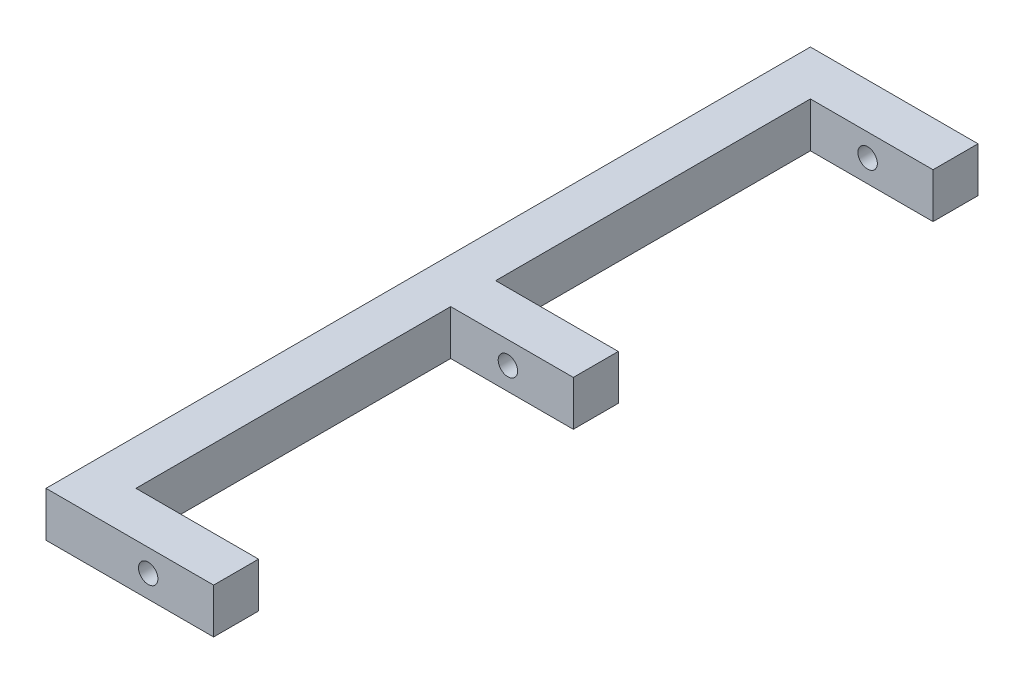
ISO-10303-21;
HEADER;
FILE_DESCRIPTION(('STEP AP214'),'2;1');
FILE_NAME('part.step','',(''),(''),'','','');
FILE_SCHEMA(('AUTOMOTIVE_DESIGN { 1 0 10303 214 1 1 1 1 }'));
ENDSEC;
DATA;
#1=APPLICATION_CONTEXT('core data for automotive mechanical design processes');
#2=APPLICATION_PROTOCOL_DEFINITION('international standard','automotive_design',2000,#1);
#3=PRODUCT_CONTEXT('',#1,'mechanical');
#4=PRODUCT('Part','Part','',(#3));
#5=PRODUCT_RELATED_PRODUCT_CATEGORY('part','',(#4));
#6=PRODUCT_DEFINITION_FORMATION('','',#4);
#7=PRODUCT_DEFINITION_CONTEXT('part definition',#1,'design');
#8=PRODUCT_DEFINITION('design','',#6,#7);
#9=PRODUCT_DEFINITION_SHAPE('','',#8);
#10=(LENGTH_UNIT() NAMED_UNIT(*) SI_UNIT(.MILLI.,.METRE.));
#11=(NAMED_UNIT(*) PLANE_ANGLE_UNIT() SI_UNIT($,.RADIAN.));
#12=(NAMED_UNIT(*) SI_UNIT($,.STERADIAN.) SOLID_ANGLE_UNIT());
#13=UNCERTAINTY_MEASURE_WITH_UNIT(LENGTH_MEASURE(1.E-05),#10,'distance_accuracy_value','');
#14=(GEOMETRIC_REPRESENTATION_CONTEXT(3) GLOBAL_UNCERTAINTY_ASSIGNED_CONTEXT((#13)) GLOBAL_UNIT_ASSIGNED_CONTEXT((#10,
#11,#12)) REPRESENTATION_CONTEXT('',''));
#15=CARTESIAN_POINT('',(0.,0.,0.));
#16=DIRECTION('',(0.,0.,1.));
#17=DIRECTION('',(1.,0.,0.));
#18=AXIS2_PLACEMENT_3D('',#15,#16,#17);
#19=CARTESIAN_POINT('',(22.,0.,374.));
#20=DIRECTION('',(-1.,0.,0.));
#21=DIRECTION('',(0.,0.,1.));
#22=AXIS2_PLACEMENT_3D('',#19,#20,#21);
#23=PLANE('',#22);
#24=DIRECTION('',(0.,-1.,0.));
#25=VECTOR('',#24,1.);
#26=CARTESIAN_POINT('',(22.,22.,22.));
#27=LINE('',#26,#25);
#28=CARTESIAN_POINT('',(22.,22.,22.0000000000001));
#29=VERTEX_POINT('',#28);
#30=CARTESIAN_POINT('',(22.,0.,22.0000000000001));
#31=VERTEX_POINT('',#30);
#32=EDGE_CURVE('E51',#29,#31,#27,.T.);
#33=ORIENTED_EDGE('',*,*,#32,.F.);
#34=DIRECTION('',(0.,0.,-1.));
#35=VECTOR('',#34,1.);
#36=CARTESIAN_POINT('',(22.,22.,374.));
#37=LINE('',#36,#35);
#38=CARTESIAN_POINT('',(22.,22.,176.));
#39=VERTEX_POINT('',#38);
#40=EDGE_CURVE('E142',#39,#29,#37,.T.);
#41=ORIENTED_EDGE('',*,*,#40,.F.);
#42=DIRECTION('',(0.,1.,0.));
#43=VECTOR('',#42,1.);
#44=CARTESIAN_POINT('',(22.,22.,176.));
#45=LINE('',#44,#43);
#46=CARTESIAN_POINT('',(22.,0.,176.));
#47=VERTEX_POINT('',#46);
#48=EDGE_CURVE('E146',#47,#39,#45,.T.);
#49=ORIENTED_EDGE('',*,*,#48,.F.);
#50=DIRECTION('',(0.,0.,-1.));
#51=VECTOR('',#50,1.);
#52=CARTESIAN_POINT('',(22.,0.,374.));
#53=LINE('',#52,#51);
#54=EDGE_CURVE('E47',#47,#31,#53,.T.);
#55=ORIENTED_EDGE('',*,*,#54,.T.);
#56=EDGE_LOOP('',(#33,#41,#49,#55));
#57=FACE_BOUND('',#56,.T.);
#58=ADVANCED_FACE('F30',(#57),#23,.F.);
#59=DIRECTION('',(0.,-1.,0.));
#60=VECTOR('',#59,1.);
#61=CARTESIAN_POINT('',(22.,22.,198.));
#62=LINE('',#61,#60);
#63=CARTESIAN_POINT('',(22.,22.,198.));
#64=VERTEX_POINT('',#63);
#65=CARTESIAN_POINT('',(22.,0.,198.));
#66=VERTEX_POINT('',#65);
#67=EDGE_CURVE('E143',#64,#66,#62,.T.);
#68=ORIENTED_EDGE('',*,*,#67,.F.);
#69=CARTESIAN_POINT('',(22.,22.,352.));
#70=VERTEX_POINT('',#69);
#71=EDGE_CURVE('E203',#70,#64,#37,.T.);
#72=ORIENTED_EDGE('',*,*,#71,.F.);
#73=DIRECTION('',(0.,1.,0.));
#74=VECTOR('',#73,1.);
#75=CARTESIAN_POINT('',(22.,22.,352.));
#76=LINE('',#75,#74);
#77=CARTESIAN_POINT('',(22.,0.,352.));
#78=VERTEX_POINT('',#77);
#79=EDGE_CURVE('E170',#78,#70,#76,.T.);
#80=ORIENTED_EDGE('',*,*,#79,.F.);
#81=EDGE_CURVE('E39',#78,#66,#53,.T.);
#82=ORIENTED_EDGE('',*,*,#81,.T.);
#83=EDGE_LOOP('',(#68,#72,#80,#82));
#84=FACE_BOUND('',#83,.T.);
#85=ADVANCED_FACE('F216',(#84),#23,.F.);
#86=CARTESIAN_POINT('',(0.,0.,374.));
#87=DIRECTION('',(1.,0.,0.));
#88=DIRECTION('',(0.,0.,-1.));
#89=AXIS2_PLACEMENT_3D('',#86,#87,#88);
#90=PLANE('',#89);
#91=DIRECTION('',(0.,-1.,0.));
#92=VECTOR('',#91,1.);
#93=CARTESIAN_POINT('',(0.,0.,0.));
#94=LINE('',#93,#92);
#95=CARTESIAN_POINT('',(0.,22.,0.));
#96=VERTEX_POINT('',#95);
#97=CARTESIAN_POINT('',(0.,0.,0.));
#98=VERTEX_POINT('',#97);
#99=EDGE_CURVE('E199',#96,#98,#94,.T.);
#100=ORIENTED_EDGE('',*,*,#99,.T.);
#101=DIRECTION('',(0.,0.,-1.));
#102=VECTOR('',#101,1.);
#103=CARTESIAN_POINT('',(0.,0.,374.));
#104=LINE('',#103,#102);
#105=CARTESIAN_POINT('',(0.,0.,374.));
#106=VERTEX_POINT('',#105);
#107=EDGE_CURVE('E11',#106,#98,#104,.T.);
#108=ORIENTED_EDGE('',*,*,#107,.F.);
#109=DIRECTION('',(0.,-1.,0.));
#110=VECTOR('',#109,1.);
#111=CARTESIAN_POINT('',(0.,0.,374.));
#112=LINE('',#111,#110);
#113=CARTESIAN_POINT('',(0.,22.,374.));
#114=VERTEX_POINT('',#113);
#115=EDGE_CURVE('E184',#114,#106,#112,.T.);
#116=ORIENTED_EDGE('',*,*,#115,.F.);
#117=DIRECTION('',(0.,0.,-1.));
#118=VECTOR('',#117,1.);
#119=CARTESIAN_POINT('',(0.,22.,374.));
#120=LINE('',#119,#118);
#121=EDGE_CURVE('E204',#114,#96,#120,.T.);
#122=ORIENTED_EDGE('',*,*,#121,.T.);
#123=EDGE_LOOP('',(#100,#108,#116,#122));
#124=FACE_BOUND('',#123,.T.);
#125=ADVANCED_FACE('F32',(#124),#90,.F.);
#126=CARTESIAN_POINT('',(0.,0.,374.));
#127=DIRECTION('',(0.,1.,0.));
#128=DIRECTION('',(0.,0.,1.));
#129=AXIS2_PLACEMENT_3D('',#126,#127,#128);
#130=PLANE('',#129);
#131=DIRECTION('',(1.,0.,0.));
#132=VECTOR('',#131,1.);
#133=CARTESIAN_POINT('',(0.,0.,0.));
#134=LINE('',#133,#132);
#135=CARTESIAN_POINT('',(82.,0.,0.));
#136=VERTEX_POINT('',#135);
#137=EDGE_CURVE('E244',#98,#136,#134,.T.);
#138=ORIENTED_EDGE('',*,*,#137,.T.);
#139=DIRECTION('',(0.,0.,-1.));
#140=VECTOR('',#139,1.);
#141=CARTESIAN_POINT('',(82.,0.,0.));
#142=LINE('',#141,#140);
#143=CARTESIAN_POINT('',(82.,0.,22.));
#144=VERTEX_POINT('',#143);
#145=EDGE_CURVE('E131',#144,#136,#142,.T.);
#146=ORIENTED_EDGE('',*,*,#145,.F.);
#147=DIRECTION('',(-1.,0.,0.));
#148=VECTOR('',#147,1.);
#149=CARTESIAN_POINT('',(82.,0.,22.));
#150=LINE('',#149,#148);
#151=EDGE_CURVE('E127',#144,#31,#150,.T.);
#152=ORIENTED_EDGE('',*,*,#151,.T.);
#153=ORIENTED_EDGE('',*,*,#54,.F.);
#154=DIRECTION('',(-1.,0.,0.));
#155=VECTOR('',#154,1.);
#156=CARTESIAN_POINT('',(82.,0.,176.));
#157=LINE('',#156,#155);
#158=CARTESIAN_POINT('',(82.,0.,176.));
#159=VERTEX_POINT('',#158);
#160=EDGE_CURVE('E166',#159,#47,#157,.T.);
#161=ORIENTED_EDGE('',*,*,#160,.F.);
#162=DIRECTION('',(0.,0.,-1.));
#163=VECTOR('',#162,1.);
#164=CARTESIAN_POINT('',(82.,0.,198.));
#165=LINE('',#164,#163);
#166=CARTESIAN_POINT('',(82.,0.,198.));
#167=VERTEX_POINT('',#166);
#168=EDGE_CURVE('E154',#167,#159,#165,.T.);
#169=ORIENTED_EDGE('',*,*,#168,.F.);
#170=DIRECTION('',(-1.,0.,0.));
#171=VECTOR('',#170,1.);
#172=CARTESIAN_POINT('',(82.,0.,198.));
#173=LINE('',#172,#171);
#174=EDGE_CURVE('E168',#167,#66,#173,.T.);
#175=ORIENTED_EDGE('',*,*,#174,.T.);
#176=ORIENTED_EDGE('',*,*,#81,.F.);
#177=DIRECTION('',(-1.,0.,0.));
#178=VECTOR('',#177,1.);
#179=CARTESIAN_POINT('',(82.,0.,352.));
#180=LINE('',#179,#178);
#181=CARTESIAN_POINT('',(82.,0.,352.));
#182=VERTEX_POINT('',#181);
#183=EDGE_CURVE('E194',#182,#78,#180,.T.);
#184=ORIENTED_EDGE('',*,*,#183,.F.);
#185=DIRECTION('',(0.,0.,-1.));
#186=VECTOR('',#185,1.);
#187=CARTESIAN_POINT('',(82.,0.,374.));
#188=LINE('',#187,#186);
#189=CARTESIAN_POINT('',(82.,0.,374.));
#190=VERTEX_POINT('',#189);
#191=EDGE_CURVE('E174',#190,#182,#188,.T.);
#192=ORIENTED_EDGE('',*,*,#191,.F.);
#193=DIRECTION('',(1.,0.,0.));
#194=VECTOR('',#193,1.);
#195=CARTESIAN_POINT('',(0.,0.,374.));
#196=LINE('',#195,#194);
#197=EDGE_CURVE('E230',#106,#190,#196,.T.);
#198=ORIENTED_EDGE('',*,*,#197,.F.);
#199=ORIENTED_EDGE('',*,*,#107,.T.);
#200=EDGE_LOOP('',(#138,#146,#152,#153,#161,#169,#175,#176,#184,#192,#198,#199));
#201=FACE_BOUND('',#200,.T.);
#202=ADVANCED_FACE('F219',(#201),#130,.F.);
#203=CARTESIAN_POINT('',(0.,22.,374.));
#204=DIRECTION('',(0.,-1.,0.));
#205=DIRECTION('',(0.,0.,-1.));
#206=AXIS2_PLACEMENT_3D('',#203,#204,#205);
#207=PLANE('',#206);
#208=DIRECTION('',(-1.,0.,0.));
#209=VECTOR('',#208,1.);
#210=CARTESIAN_POINT('',(0.,22.,0.));
#211=LINE('',#210,#209);
#212=CARTESIAN_POINT('',(82.,22.,0.));
#213=VERTEX_POINT('',#212);
#214=EDGE_CURVE('E241',#213,#96,#211,.T.);
#215=ORIENTED_EDGE('',*,*,#214,.T.);
#216=ORIENTED_EDGE('',*,*,#121,.F.);
#217=DIRECTION('',(-1.,0.,0.));
#218=VECTOR('',#217,1.);
#219=CARTESIAN_POINT('',(0.,22.,374.));
#220=LINE('',#219,#218);
#221=CARTESIAN_POINT('',(82.,22.,374.));
#222=VERTEX_POINT('',#221);
#223=EDGE_CURVE('E235',#222,#114,#220,.T.);
#224=ORIENTED_EDGE('',*,*,#223,.F.);
#225=DIRECTION('',(0.,0.,1.));
#226=VECTOR('',#225,1.);
#227=CARTESIAN_POINT('',(82.,22.,374.));
#228=LINE('',#227,#226);
#229=CARTESIAN_POINT('',(82.,22.,352.));
#230=VERTEX_POINT('',#229);
#231=EDGE_CURVE('E178',#230,#222,#228,.T.);
#232=ORIENTED_EDGE('',*,*,#231,.F.);
#233=DIRECTION('',(-1.,0.,0.));
#234=VECTOR('',#233,1.);
#235=CARTESIAN_POINT('',(82.,22.,352.));
#236=LINE('',#235,#234);
#237=EDGE_CURVE('E181',#230,#70,#236,.T.);
#238=ORIENTED_EDGE('',*,*,#237,.T.);
#239=ORIENTED_EDGE('',*,*,#71,.T.);
#240=DIRECTION('',(-1.,0.,0.));
#241=VECTOR('',#240,1.);
#242=CARTESIAN_POINT('',(82.,22.,198.));
#243=LINE('',#242,#241);
#244=CARTESIAN_POINT('',(82.,22.,198.));
#245=VERTEX_POINT('',#244);
#246=EDGE_CURVE('E159',#245,#64,#243,.T.);
#247=ORIENTED_EDGE('',*,*,#246,.F.);
#248=DIRECTION('',(0.,0.,1.));
#249=VECTOR('',#248,1.);
#250=CARTESIAN_POINT('',(82.,22.,198.));
#251=LINE('',#250,#249);
#252=CARTESIAN_POINT('',(82.,22.,176.));
#253=VERTEX_POINT('',#252);
#254=EDGE_CURVE('E158',#253,#245,#251,.T.);
#255=ORIENTED_EDGE('',*,*,#254,.F.);
#256=DIRECTION('',(-1.,0.,0.));
#257=VECTOR('',#256,1.);
#258=CARTESIAN_POINT('',(82.,22.,176.));
#259=LINE('',#258,#257);
#260=EDGE_CURVE('E164',#253,#39,#259,.T.);
#261=ORIENTED_EDGE('',*,*,#260,.T.);
#262=ORIENTED_EDGE('',*,*,#40,.T.);
#263=DIRECTION('',(-1.,0.,0.));
#264=VECTOR('',#263,1.);
#265=CARTESIAN_POINT('',(82.,22.,22.));
#266=LINE('',#265,#264);
#267=CARTESIAN_POINT('',(82.,22.,22.));
#268=VERTEX_POINT('',#267);
#269=EDGE_CURVE('E125',#268,#29,#266,.T.);
#270=ORIENTED_EDGE('',*,*,#269,.F.);
#271=DIRECTION('',(0.,0.,1.));
#272=VECTOR('',#271,1.);
#273=CARTESIAN_POINT('',(82.,22.,0.));
#274=LINE('',#273,#272);
#275=EDGE_CURVE('E132',#213,#268,#274,.T.);
#276=ORIENTED_EDGE('',*,*,#275,.F.);
#277=EDGE_LOOP('',(#215,#216,#224,#232,#238,#239,#247,#255,#261,#262,#270,#276));
#278=FACE_BOUND('',#277,.T.);
#279=ADVANCED_FACE('F141',(#278),#207,.F.);
#280=CARTESIAN_POINT('',(0.,22.,374.));
#281=DIRECTION('',(0.,0.,-1.));
#282=DIRECTION('',(-1.,0.,0.));
#283=AXIS2_PLACEMENT_3D('',#280,#281,#282);
#284=PLANE('',#283);
#285=CARTESIAN_POINT('',(50.,11.,374.));
#286=DIRECTION('',(0.,0.,1.));
#287=DIRECTION('',(1.,0.,0.));
#288=AXIS2_PLACEMENT_3D('',#285,#286,#287);
#289=CIRCLE('',#288,4.75);
#290=CARTESIAN_POINT('',(54.75,11.,374.));
#291=VERTEX_POINT('',#290);
#292=EDGE_CURVE('E266',#291,#291,#289,.T.);
#293=ORIENTED_EDGE('',*,*,#292,.F.);
#294=EDGE_LOOP('',(#293));
#295=FACE_BOUND('',#294,.T.);
#296=ORIENTED_EDGE('',*,*,#115,.T.);
#297=ORIENTED_EDGE('',*,*,#197,.T.);
#298=DIRECTION('',(0.,-1.,0.));
#299=VECTOR('',#298,1.);
#300=CARTESIAN_POINT('',(82.,22.,374.));
#301=LINE('',#300,#299);
#302=EDGE_CURVE('E171',#222,#190,#301,.T.);
#303=ORIENTED_EDGE('',*,*,#302,.F.);
#304=ORIENTED_EDGE('',*,*,#223,.T.);
#305=EDGE_LOOP('',(#296,#297,#303,#304));
#306=FACE_BOUND('',#305,.T.);
#307=ADVANCED_FACE('F237',(#295,#306),#284,.F.);
#308=CARTESIAN_POINT('',(0.,22.,0.));
#309=DIRECTION('',(0.,0.,-1.));
#310=DIRECTION('',(-1.,0.,0.));
#311=AXIS2_PLACEMENT_3D('',#308,#309,#310);
#312=PLANE('',#311);
#313=CARTESIAN_POINT('',(50.,11.,0.));
#314=DIRECTION('',(0.,0.,-1.));
#315=DIRECTION('',(-1.,0.,0.));
#316=AXIS2_PLACEMENT_3D('',#313,#314,#315);
#317=CIRCLE('',#316,4.75);
#318=CARTESIAN_POINT('',(45.25,11.,0.));
#319=VERTEX_POINT('',#318);
#320=EDGE_CURVE('E263',#319,#319,#317,.F.);
#321=ORIENTED_EDGE('',*,*,#320,.T.);
#322=EDGE_LOOP('',(#321));
#323=FACE_BOUND('',#322,.T.);
#324=ORIENTED_EDGE('',*,*,#99,.F.);
#325=ORIENTED_EDGE('',*,*,#214,.F.);
#326=DIRECTION('',(0.,1.,0.));
#327=VECTOR('',#326,1.);
#328=CARTESIAN_POINT('',(82.,22.,0.));
#329=LINE('',#328,#327);
#330=EDGE_CURVE('E138',#136,#213,#329,.T.);
#331=ORIENTED_EDGE('',*,*,#330,.F.);
#332=ORIENTED_EDGE('',*,*,#137,.F.);
#333=EDGE_LOOP('',(#324,#325,#331,#332));
#334=FACE_BOUND('',#333,.T.);
#335=ADVANCED_FACE('F248',(#323,#334),#312,.T.);
#336=CARTESIAN_POINT('',(82.,22.,352.));
#337=DIRECTION('',(0.,0.,1.));
#338=DIRECTION('',(1.,0.,0.));
#339=AXIS2_PLACEMENT_3D('',#336,#337,#338);
#340=PLANE('',#339);
#341=CARTESIAN_POINT('',(50.,11.,352.));
#342=DIRECTION('',(0.,0.,1.));
#343=DIRECTION('',(1.,0.,0.));
#344=AXIS2_PLACEMENT_3D('',#341,#342,#343);
#345=CIRCLE('',#344,4.75);
#346=CARTESIAN_POINT('',(54.75,11.,352.));
#347=VERTEX_POINT('',#346);
#348=EDGE_CURVE('E251',#347,#347,#345,.T.);
#349=ORIENTED_EDGE('',*,*,#348,.T.);
#350=EDGE_LOOP('',(#349));
#351=FACE_BOUND('',#350,.T.);
#352=ORIENTED_EDGE('',*,*,#79,.T.);
#353=ORIENTED_EDGE('',*,*,#237,.F.);
#354=DIRECTION('',(0.,1.,0.));
#355=VECTOR('',#354,1.);
#356=CARTESIAN_POINT('',(82.,22.,352.));
#357=LINE('',#356,#355);
#358=EDGE_CURVE('E176',#182,#230,#357,.T.);
#359=ORIENTED_EDGE('',*,*,#358,.F.);
#360=ORIENTED_EDGE('',*,*,#183,.T.);
#361=EDGE_LOOP('',(#352,#353,#359,#360));
#362=FACE_BOUND('',#361,.T.);
#363=ADVANCED_FACE('F224',(#351,#362),#340,.F.);
#364=CARTESIAN_POINT('',(82.,0.,374.));
#365=DIRECTION('',(1.,0.,0.));
#366=DIRECTION('',(0.,0.,-1.));
#367=AXIS2_PLACEMENT_3D('',#364,#365,#366);
#368=PLANE('',#367);
#369=ORIENTED_EDGE('',*,*,#302,.T.);
#370=ORIENTED_EDGE('',*,*,#191,.T.);
#371=ORIENTED_EDGE('',*,*,#358,.T.);
#372=ORIENTED_EDGE('',*,*,#231,.T.);
#373=EDGE_LOOP('',(#369,#370,#371,#372));
#374=FACE_BOUND('',#373,.T.);
#375=ADVANCED_FACE('F228',(#374),#368,.T.);
#376=CARTESIAN_POINT('',(82.,22.,198.));
#377=DIRECTION('',(0.,0.,-1.));
#378=DIRECTION('',(-1.,0.,0.));
#379=AXIS2_PLACEMENT_3D('',#376,#377,#378);
#380=PLANE('',#379);
#381=CARTESIAN_POINT('',(50.,11.,198.));
#382=DIRECTION('',(0.,0.,-1.));
#383=DIRECTION('',(-1.,0.,0.));
#384=AXIS2_PLACEMENT_3D('',#381,#382,#383);
#385=CIRCLE('',#384,4.75);
#386=CARTESIAN_POINT('',(45.25,11.,198.));
#387=VERTEX_POINT('',#386);
#388=EDGE_CURVE('E253',#387,#387,#385,.T.);
#389=ORIENTED_EDGE('',*,*,#388,.T.);
#390=EDGE_LOOP('',(#389));
#391=FACE_BOUND('',#390,.T.);
#392=ORIENTED_EDGE('',*,*,#67,.T.);
#393=ORIENTED_EDGE('',*,*,#174,.F.);
#394=DIRECTION('',(0.,-1.,0.));
#395=VECTOR('',#394,1.);
#396=CARTESIAN_POINT('',(82.,22.,198.));
#397=LINE('',#396,#395);
#398=EDGE_CURVE('E151',#245,#167,#397,.T.);
#399=ORIENTED_EDGE('',*,*,#398,.F.);
#400=ORIENTED_EDGE('',*,*,#246,.T.);
#401=EDGE_LOOP('',(#392,#393,#399,#400));
#402=FACE_BOUND('',#401,.T.);
#403=ADVANCED_FACE('F324',(#391,#402),#380,.F.);
#404=CARTESIAN_POINT('',(82.,22.,176.));
#405=DIRECTION('',(0.,0.,1.));
#406=DIRECTION('',(1.,0.,0.));
#407=AXIS2_PLACEMENT_3D('',#404,#405,#406);
#408=PLANE('',#407);
#409=CARTESIAN_POINT('',(50.,11.,176.));
#410=DIRECTION('',(0.,0.,1.));
#411=DIRECTION('',(1.,0.,0.));
#412=AXIS2_PLACEMENT_3D('',#409,#410,#411);
#413=CIRCLE('',#412,4.75);
#414=CARTESIAN_POINT('',(54.75,11.,176.));
#415=VERTEX_POINT('',#414);
#416=EDGE_CURVE('E258',#415,#415,#413,.T.);
#417=ORIENTED_EDGE('',*,*,#416,.T.);
#418=EDGE_LOOP('',(#417));
#419=FACE_BOUND('',#418,.T.);
#420=ORIENTED_EDGE('',*,*,#48,.T.);
#421=ORIENTED_EDGE('',*,*,#260,.F.);
#422=DIRECTION('',(0.,1.,0.));
#423=VECTOR('',#422,1.);
#424=CARTESIAN_POINT('',(82.,22.,176.));
#425=LINE('',#424,#423);
#426=EDGE_CURVE('E156',#159,#253,#425,.T.);
#427=ORIENTED_EDGE('',*,*,#426,.F.);
#428=ORIENTED_EDGE('',*,*,#160,.T.);
#429=EDGE_LOOP('',(#420,#421,#427,#428));
#430=FACE_BOUND('',#429,.T.);
#431=ADVANCED_FACE('F338',(#419,#430),#408,.F.);
#432=CARTESIAN_POINT('',(82.,0.,198.));
#433=DIRECTION('',(1.,0.,0.));
#434=DIRECTION('',(0.,0.,-1.));
#435=AXIS2_PLACEMENT_3D('',#432,#433,#434);
#436=PLANE('',#435);
#437=ORIENTED_EDGE('',*,*,#398,.T.);
#438=ORIENTED_EDGE('',*,*,#168,.T.);
#439=ORIENTED_EDGE('',*,*,#426,.T.);
#440=ORIENTED_EDGE('',*,*,#254,.T.);
#441=EDGE_LOOP('',(#437,#438,#439,#440));
#442=FACE_BOUND('',#441,.T.);
#443=ADVANCED_FACE('F333',(#442),#436,.T.);
#444=CARTESIAN_POINT('',(82.,22.,22.));
#445=DIRECTION('',(0.,0.,-1.));
#446=DIRECTION('',(-1.,0.,0.));
#447=AXIS2_PLACEMENT_3D('',#444,#445,#446);
#448=PLANE('',#447);
#449=CARTESIAN_POINT('',(50.,11.,22.));
#450=DIRECTION('',(0.,0.,-1.));
#451=DIRECTION('',(-1.,0.,0.));
#452=AXIS2_PLACEMENT_3D('',#449,#450,#451);
#453=CIRCLE('',#452,4.75);
#454=CARTESIAN_POINT('',(45.25,11.,22.));
#455=VERTEX_POINT('',#454);
#456=EDGE_CURVE('E34',#455,#455,#453,.T.);
#457=ORIENTED_EDGE('',*,*,#456,.T.);
#458=EDGE_LOOP('',(#457));
#459=FACE_BOUND('',#458,.T.);
#460=ORIENTED_EDGE('',*,*,#32,.T.);
#461=ORIENTED_EDGE('',*,*,#151,.F.);
#462=DIRECTION('',(0.,-1.,0.));
#463=VECTOR('',#462,1.);
#464=CARTESIAN_POINT('',(82.,22.,22.));
#465=LINE('',#464,#463);
#466=EDGE_CURVE('E121',#268,#144,#465,.T.);
#467=ORIENTED_EDGE('',*,*,#466,.F.);
#468=ORIENTED_EDGE('',*,*,#269,.T.);
#469=EDGE_LOOP('',(#460,#461,#467,#468));
#470=FACE_BOUND('',#469,.T.);
#471=ADVANCED_FACE('F123',(#459,#470),#448,.F.);
#472=CARTESIAN_POINT('',(82.,22.,22.));
#473=DIRECTION('',(1.,0.,0.));
#474=DIRECTION('',(0.,0.,-1.));
#475=AXIS2_PLACEMENT_3D('',#472,#473,#474);
#476=PLANE('',#475);
#477=ORIENTED_EDGE('',*,*,#275,.T.);
#478=ORIENTED_EDGE('',*,*,#466,.T.);
#479=ORIENTED_EDGE('',*,*,#145,.T.);
#480=ORIENTED_EDGE('',*,*,#330,.T.);
#481=EDGE_LOOP('',(#477,#478,#479,#480));
#482=FACE_BOUND('',#481,.T.);
#483=ADVANCED_FACE('F136',(#482),#476,.T.);
#484=CARTESIAN_POINT('',(50.,11.,-13.4350288425444));
#485=DIRECTION('',(0.,0.,1.));
#486=DIRECTION('',(1.,0.,0.));
#487=AXIS2_PLACEMENT_3D('',#484,#485,#486);
#488=CYLINDRICAL_SURFACE('',#487,4.75);
#489=ORIENTED_EDGE('',*,*,#320,.F.);
#490=EDGE_LOOP('',(#489));
#491=FACE_BOUND('',#490,.T.);
#492=ORIENTED_EDGE('',*,*,#456,.F.);
#493=EDGE_LOOP('',(#492));
#494=FACE_BOUND('',#493,.T.);
#495=ADVANCED_FACE('F351',(#491,#494),#488,.F.);
#496=ORIENTED_EDGE('',*,*,#416,.F.);
#497=EDGE_LOOP('',(#496));
#498=FACE_BOUND('',#497,.T.);
#499=ORIENTED_EDGE('',*,*,#388,.F.);
#500=EDGE_LOOP('',(#499));
#501=FACE_BOUND('',#500,.T.);
#502=ADVANCED_FACE('F397',(#498,#501),#488,.F.);
#503=ORIENTED_EDGE('',*,*,#292,.T.);
#504=EDGE_LOOP('',(#503));
#505=FACE_BOUND('',#504,.T.);
#506=ORIENTED_EDGE('',*,*,#348,.F.);
#507=EDGE_LOOP('',(#506));
#508=FACE_BOUND('',#507,.T.);
#509=ADVANCED_FACE('F270',(#505,#508),#488,.F.);
#510=CLOSED_SHELL('',(#58,#85,#125,#202,#279,#307,#335,#363,#375,#403,#431,#443,#471,#483,#495,
#502,#509));
#511=MANIFOLD_SOLID_BREP('B2',#510);
#512=ADVANCED_BREP_SHAPE_REPRESENTATION('',(#18,#511),#14);
#513=SHAPE_DEFINITION_REPRESENTATION(#9,#512);
ENDSEC;
END-ISO-10303-21;
